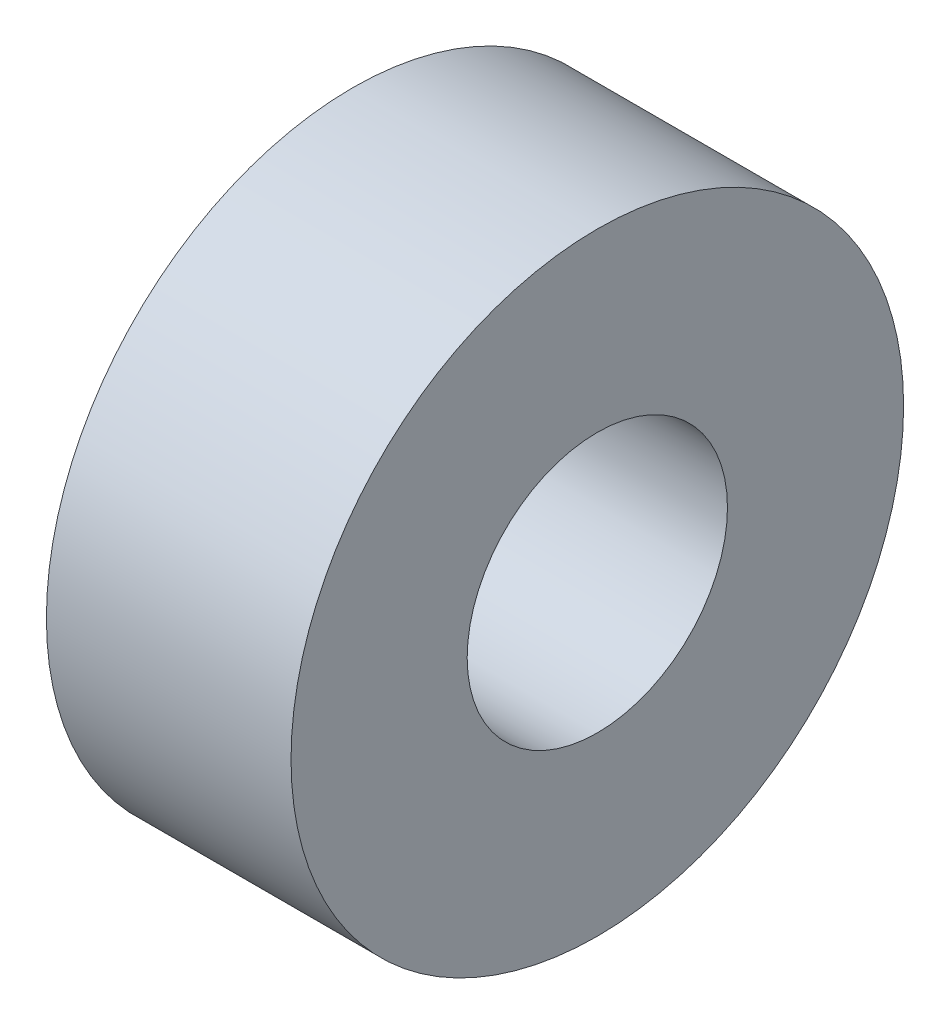
ISO-10303-21;
HEADER;
FILE_DESCRIPTION(('STEP AP214'),'2;1');
FILE_NAME('part.step','',(''),(''),'','','');
FILE_SCHEMA(('AUTOMOTIVE_DESIGN { 1 0 10303 214 1 1 1 1 }'));
ENDSEC;
DATA;
#1=APPLICATION_CONTEXT('core data for automotive mechanical design processes');
#2=APPLICATION_PROTOCOL_DEFINITION('international standard','automotive_design',2000,#1);
#3=PRODUCT_CONTEXT('',#1,'mechanical');
#4=PRODUCT('Part','Part','',(#3));
#5=PRODUCT_RELATED_PRODUCT_CATEGORY('part','',(#4));
#6=PRODUCT_DEFINITION_FORMATION('','',#4);
#7=PRODUCT_DEFINITION_CONTEXT('part definition',#1,'design');
#8=PRODUCT_DEFINITION('design','',#6,#7);
#9=PRODUCT_DEFINITION_SHAPE('','',#8);
#10=(LENGTH_UNIT() NAMED_UNIT(*) SI_UNIT(.MILLI.,.METRE.));
#11=(NAMED_UNIT(*) PLANE_ANGLE_UNIT() SI_UNIT($,.RADIAN.));
#12=(NAMED_UNIT(*) SI_UNIT($,.STERADIAN.) SOLID_ANGLE_UNIT());
#13=UNCERTAINTY_MEASURE_WITH_UNIT(LENGTH_MEASURE(1.E-05),#10,'distance_accuracy_value','');
#14=(GEOMETRIC_REPRESENTATION_CONTEXT(3) GLOBAL_UNCERTAINTY_ASSIGNED_CONTEXT((#13)) GLOBAL_UNIT_ASSIGNED_CONTEXT((#10,
#11,#12)) REPRESENTATION_CONTEXT('',''));
#15=CARTESIAN_POINT('',(0.,0.,0.));
#16=DIRECTION('',(0.,0.,1.));
#17=DIRECTION('',(1.,0.,0.));
#18=AXIS2_PLACEMENT_3D('',#15,#16,#17);
#19=CARTESIAN_POINT('',(6.35,0.,0.));
#20=DIRECTION('',(1.,0.,0.));
#21=DIRECTION('',(0.,0.,-1.));
#22=AXIS2_PLACEMENT_3D('',#19,#20,#21);
#23=PLANE('',#22);
#24=CARTESIAN_POINT('',(6.35,0.,0.));
#25=DIRECTION('',(1.,0.,0.));
#26=DIRECTION('',(0.,0.,-1.));
#27=AXIS2_PLACEMENT_3D('',#24,#25,#26);
#28=CIRCLE('',#27,7.9502);
#29=CARTESIAN_POINT('',(6.35,0.,-7.9502));
#30=VERTEX_POINT('',#29);
#31=EDGE_CURVE('E10',#30,#30,#28,.T.);
#32=ORIENTED_EDGE('',*,*,#31,.T.);
#33=EDGE_LOOP('',(#32));
#34=FACE_BOUND('',#33,.T.);
#35=CARTESIAN_POINT('',(6.35,0.,0.));
#36=DIRECTION('',(1.,0.,0.));
#37=DIRECTION('',(0.,0.,-1.));
#38=AXIS2_PLACEMENT_3D('',#35,#36,#37);
#39=CIRCLE('',#38,3.3782);
#40=CARTESIAN_POINT('',(6.35,0.,-3.3782));
#41=VERTEX_POINT('',#40);
#42=EDGE_CURVE('E41',#41,#41,#39,.T.);
#43=ORIENTED_EDGE('',*,*,#42,.F.);
#44=EDGE_LOOP('',(#43));
#45=FACE_BOUND('',#44,.T.);
#46=ADVANCED_FACE('F30',(#34,#45),#23,.T.);
#47=CARTESIAN_POINT('',(0.,0.,0.));
#48=DIRECTION('',(1.,0.,0.));
#49=DIRECTION('',(0.,0.,-1.));
#50=AXIS2_PLACEMENT_3D('',#47,#48,#49);
#51=PLANE('',#50);
#52=CARTESIAN_POINT('',(0.,0.,0.));
#53=DIRECTION('',(1.,0.,0.));
#54=DIRECTION('',(0.,0.,-1.));
#55=AXIS2_PLACEMENT_3D('',#52,#53,#54);
#56=CIRCLE('',#55,7.9502);
#57=CARTESIAN_POINT('',(0.,0.,-7.9502));
#58=VERTEX_POINT('',#57);
#59=EDGE_CURVE('E34',#58,#58,#56,.T.);
#60=ORIENTED_EDGE('',*,*,#59,.F.);
#61=EDGE_LOOP('',(#60));
#62=FACE_BOUND('',#61,.T.);
#63=CARTESIAN_POINT('',(0.,0.,0.));
#64=DIRECTION('',(1.,0.,0.));
#65=DIRECTION('',(0.,0.,-1.));
#66=AXIS2_PLACEMENT_3D('',#63,#64,#65);
#67=CIRCLE('',#66,3.3782);
#68=CARTESIAN_POINT('',(0.,0.,-3.3782));
#69=VERTEX_POINT('',#68);
#70=EDGE_CURVE('E43',#69,#69,#67,.T.);
#71=ORIENTED_EDGE('',*,*,#70,.T.);
#72=EDGE_LOOP('',(#71));
#73=FACE_BOUND('',#72,.T.);
#74=ADVANCED_FACE('F53',(#62,#73),#51,.F.);
#75=CARTESIAN_POINT('',(6.35,0.,0.));
#76=DIRECTION('',(-1.,0.,0.));
#77=DIRECTION('',(0.,0.,1.));
#78=AXIS2_PLACEMENT_3D('',#75,#76,#77);
#79=CYLINDRICAL_SURFACE('',#78,7.9502);
#80=ORIENTED_EDGE('',*,*,#31,.F.);
#81=EDGE_LOOP('',(#80));
#82=FACE_BOUND('',#81,.T.);
#83=ORIENTED_EDGE('',*,*,#59,.T.);
#84=EDGE_LOOP('',(#83));
#85=FACE_BOUND('',#84,.T.);
#86=ADVANCED_FACE('F32',(#82,#85),#79,.T.);
#87=CARTESIAN_POINT('',(6.35,0.,0.));
#88=DIRECTION('',(-1.,0.,0.));
#89=DIRECTION('',(0.,0.,1.));
#90=AXIS2_PLACEMENT_3D('',#87,#88,#89);
#91=CYLINDRICAL_SURFACE('',#90,3.3782);
#92=ORIENTED_EDGE('',*,*,#42,.T.);
#93=EDGE_LOOP('',(#92));
#94=FACE_BOUND('',#93,.T.);
#95=ORIENTED_EDGE('',*,*,#70,.F.);
#96=EDGE_LOOP('',(#95));
#97=FACE_BOUND('',#96,.T.);
#98=ADVANCED_FACE('F49',(#94,#97),#91,.F.);
#99=CLOSED_SHELL('',(#46,#74,#86,#98));
#100=MANIFOLD_SOLID_BREP('B2',#99);
#101=ADVANCED_BREP_SHAPE_REPRESENTATION('',(#18,#100),#14);
#102=SHAPE_DEFINITION_REPRESENTATION(#9,#101);
ENDSEC;
END-ISO-10303-21;
